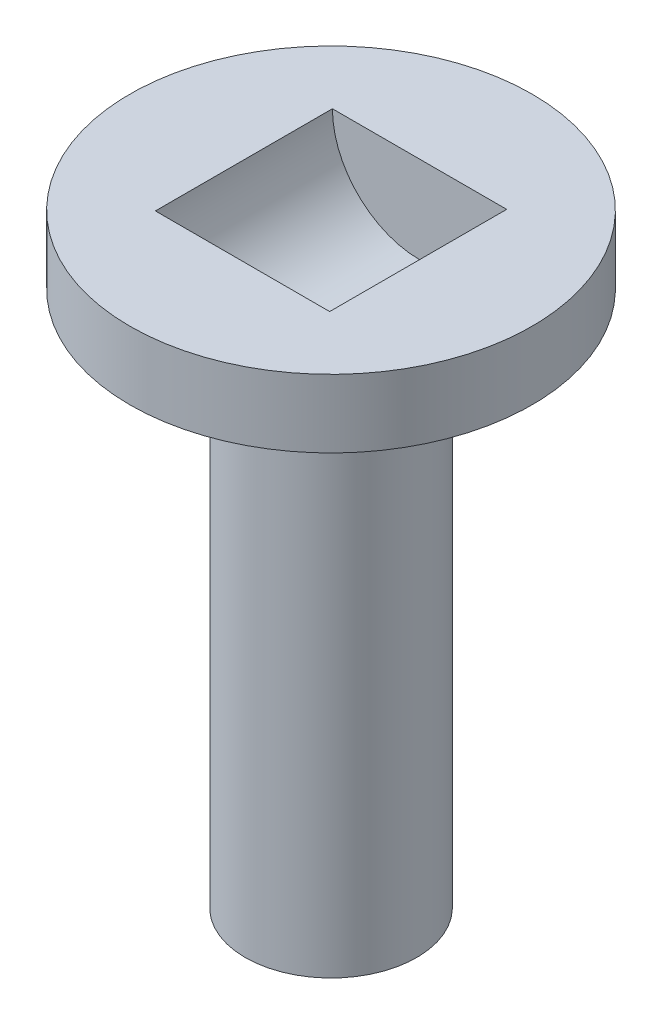
ISO-10303-21;
HEADER;
FILE_DESCRIPTION(('STEP AP214'),'2;1');
FILE_NAME('part.step','',(''),(''),'','','');
FILE_SCHEMA(('AUTOMOTIVE_DESIGN { 1 0 10303 214 1 1 1 1 }'));
ENDSEC;
DATA;
#1=APPLICATION_CONTEXT('core data for automotive mechanical design processes');
#2=APPLICATION_PROTOCOL_DEFINITION('international standard','automotive_design',2000,#1);
#3=PRODUCT_CONTEXT('',#1,'mechanical');
#4=PRODUCT('Part','Part','',(#3));
#5=PRODUCT_RELATED_PRODUCT_CATEGORY('part','',(#4));
#6=PRODUCT_DEFINITION_FORMATION('','',#4);
#7=PRODUCT_DEFINITION_CONTEXT('part definition',#1,'design');
#8=PRODUCT_DEFINITION('design','',#6,#7);
#9=PRODUCT_DEFINITION_SHAPE('','',#8);
#10=(LENGTH_UNIT() NAMED_UNIT(*) SI_UNIT(.MILLI.,.METRE.));
#11=(NAMED_UNIT(*) PLANE_ANGLE_UNIT() SI_UNIT($,.RADIAN.));
#12=(NAMED_UNIT(*) SI_UNIT($,.STERADIAN.) SOLID_ANGLE_UNIT());
#13=UNCERTAINTY_MEASURE_WITH_UNIT(LENGTH_MEASURE(1.E-05),#10,'distance_accuracy_value','');
#14=(GEOMETRIC_REPRESENTATION_CONTEXT(3) GLOBAL_UNCERTAINTY_ASSIGNED_CONTEXT((#13)) GLOBAL_UNIT_ASSIGNED_CONTEXT((#10,
#11,#12)) REPRESENTATION_CONTEXT('',''));
#15=CARTESIAN_POINT('',(0.,0.,0.));
#16=DIRECTION('',(0.,0.,1.));
#17=DIRECTION('',(1.,0.,0.));
#18=AXIS2_PLACEMENT_3D('',#15,#16,#17);
#19=CARTESIAN_POINT('',(0.,20.,0.));
#20=DIRECTION('',(0.,-1.,0.));
#21=DIRECTION('',(0.,0.,-1.));
#22=AXIS2_PLACEMENT_3D('',#19,#20,#21);
#23=CYLINDRICAL_SURFACE('',#22,3.2);
#24=CARTESIAN_POINT('',(0.,0.,0.));
#25=DIRECTION('',(0.,1.,0.));
#26=DIRECTION('',(0.,0.,1.));
#27=AXIS2_PLACEMENT_3D('',#24,#25,#26);
#28=CIRCLE('',#27,3.2);
#29=CARTESIAN_POINT('',(0.,0.,3.2));
#30=VERTEX_POINT('',#29);
#31=EDGE_CURVE('E76',#30,#30,#28,.T.);
#32=ORIENTED_EDGE('',*,*,#31,.T.);
#33=EDGE_LOOP('',(#32));
#34=FACE_BOUND('',#33,.T.);
#35=CARTESIAN_POINT('',(0.,19.19,0.));
#36=DIRECTION('',(0.,1.,0.));
#37=DIRECTION('',(0.,0.,1.));
#38=AXIS2_PLACEMENT_3D('',#35,#36,#37);
#39=CIRCLE('',#38,3.2);
#40=CARTESIAN_POINT('',(0.,19.19,3.2));
#41=VERTEX_POINT('',#40);
#42=EDGE_CURVE('E64',#41,#41,#39,.T.);
#43=ORIENTED_EDGE('',*,*,#42,.F.);
#44=EDGE_LOOP('',(#43));
#45=FACE_BOUND('',#44,.T.);
#46=ADVANCED_FACE('F34',(#34,#45),#23,.T.);
#47=CARTESIAN_POINT('',(0.,0.,0.));
#48=DIRECTION('',(0.,1.,0.));
#49=DIRECTION('',(0.,0.,1.));
#50=AXIS2_PLACEMENT_3D('',#47,#48,#49);
#51=PLANE('',#50);
#52=CARTESIAN_POINT('',(0.,0.,0.));
#53=DIRECTION('',(0.,-1.,0.));
#54=DIRECTION('',(0.,0.,-1.));
#55=AXIS2_PLACEMENT_3D('',#52,#53,#54);
#56=CIRCLE('',#55,1.1);
#57=CARTESIAN_POINT('',(0.,0.,-1.1));
#58=VERTEX_POINT('',#57);
#59=EDGE_CURVE('E80',#58,#58,#56,.T.);
#60=ORIENTED_EDGE('',*,*,#59,.F.);
#61=EDGE_LOOP('',(#60));
#62=FACE_BOUND('',#61,.T.);
#63=ORIENTED_EDGE('',*,*,#31,.F.);
#64=EDGE_LOOP('',(#63));
#65=FACE_BOUND('',#64,.T.);
#66=ADVANCED_FACE('F109',(#62,#65),#51,.F.);
#67=CARTESIAN_POINT('',(0.,10.,0.));
#68=DIRECTION('',(0.,-1.,0.));
#69=DIRECTION('',(0.,0.,-1.));
#70=AXIS2_PLACEMENT_3D('',#67,#68,#69);
#71=CYLINDRICAL_SURFACE('',#70,1.1);
#72=CARTESIAN_POINT('',(0.,10.,0.));
#73=DIRECTION('',(0.,-1.,0.));
#74=DIRECTION('',(0.,0.,-1.));
#75=AXIS2_PLACEMENT_3D('',#72,#73,#74);
#76=CIRCLE('',#75,1.1);
#77=CARTESIAN_POINT('',(0.,10.,-1.1));
#78=VERTEX_POINT('',#77);
#79=EDGE_CURVE('E79',#78,#78,#76,.T.);
#80=ORIENTED_EDGE('',*,*,#79,.F.);
#81=EDGE_LOOP('',(#80));
#82=FACE_BOUND('',#81,.T.);
#83=ORIENTED_EDGE('',*,*,#59,.T.);
#84=EDGE_LOOP('',(#83));
#85=FACE_BOUND('',#84,.T.);
#86=ADVANCED_FACE('F114',(#82,#85),#71,.F.);
#87=CARTESIAN_POINT('',(0.,10.,0.));
#88=DIRECTION('',(0.,-1.,0.));
#89=DIRECTION('',(0.,0.,-1.));
#90=AXIS2_PLACEMENT_3D('',#87,#88,#89);
#91=PLANE('',#90);
#92=ORIENTED_EDGE('',*,*,#79,.T.);
#93=EDGE_LOOP('',(#92));
#94=FACE_BOUND('',#93,.T.);
#95=ADVANCED_FACE('F123',(#94),#91,.T.);
#96=CARTESIAN_POINT('',(0.,19.19,0.));
#97=DIRECTION('',(0.,1.,0.));
#98=DIRECTION('',(0.,0.,1.));
#99=AXIS2_PLACEMENT_3D('',#96,#97,#98);
#100=PLANE('',#99);
#101=CARTESIAN_POINT('',(0.,19.19,0.));
#102=DIRECTION('',(0.,1.,0.));
#103=DIRECTION('',(0.,0.,1.));
#104=AXIS2_PLACEMENT_3D('',#101,#102,#103);
#105=CIRCLE('',#104,4.85);
#106=CARTESIAN_POINT('',(0.,19.19,4.85));
#107=VERTEX_POINT('',#106);
#108=EDGE_CURVE('E94',#107,#107,#105,.T.);
#109=ORIENTED_EDGE('',*,*,#108,.F.);
#110=EDGE_LOOP('',(#109));
#111=FACE_BOUND('',#110,.T.);
#112=ORIENTED_EDGE('',*,*,#42,.T.);
#113=EDGE_LOOP('',(#112));
#114=FACE_BOUND('',#113,.T.);
#115=ADVANCED_FACE('F120',(#111,#114),#100,.F.);
#116=CARTESIAN_POINT('',(0.,19.19,0.));
#117=DIRECTION('',(0.,1.,0.));
#118=DIRECTION('',(0.,0.,1.));
#119=AXIS2_PLACEMENT_3D('',#116,#117,#118);
#120=CYLINDRICAL_SURFACE('',#119,4.85);
#121=ORIENTED_EDGE('',*,*,#108,.T.);
#122=EDGE_LOOP('',(#121));
#123=FACE_BOUND('',#122,.T.);
#124=CARTESIAN_POINT('',(0.,20.,0.));
#125=DIRECTION('',(0.,1.,0.));
#126=DIRECTION('',(0.,0.,1.));
#127=AXIS2_PLACEMENT_3D('',#124,#125,#126);
#128=CIRCLE('',#127,4.85);
#129=CARTESIAN_POINT('',(0.,20.,4.85));
#130=VERTEX_POINT('',#129);
#131=EDGE_CURVE('E89',#130,#130,#128,.T.);
#132=ORIENTED_EDGE('',*,*,#131,.F.);
#133=EDGE_LOOP('',(#132));
#134=FACE_BOUND('',#133,.T.);
#135=ADVANCED_FACE('F122',(#123,#134),#120,.T.);
#136=CARTESIAN_POINT('',(0.,22.54,0.));
#137=DIRECTION('',(0.,1.,0.));
#138=DIRECTION('',(0.,0.,1.));
#139=AXIS2_PLACEMENT_3D('',#136,#137,#138);
#140=PLANE('',#139);
#141=DIRECTION('',(1.,0.,0.));
#142=VECTOR('',#141,1.);
#143=CARTESIAN_POINT('',(0.,22.54,3.3));
#144=LINE('',#143,#142);
#145=CARTESIAN_POINT('',(-3.25,22.54,3.3));
#146=VERTEX_POINT('',#145);
#147=CARTESIAN_POINT('',(3.25,22.54,3.3));
#148=VERTEX_POINT('',#147);
#149=EDGE_CURVE('E11',#146,#148,#144,.T.);
#150=ORIENTED_EDGE('',*,*,#149,.F.);
#151=DIRECTION('',(0.,0.,-1.));
#152=VECTOR('',#151,1.);
#153=CARTESIAN_POINT('',(-3.25,22.54,3.3));
#154=LINE('',#153,#152);
#155=CARTESIAN_POINT('',(-3.25,22.54,-3.302));
#156=VERTEX_POINT('',#155);
#157=EDGE_CURVE('E54',#146,#156,#154,.T.);
#158=ORIENTED_EDGE('',*,*,#157,.T.);
#159=DIRECTION('',(1.,0.,0.));
#160=VECTOR('',#159,1.);
#161=CARTESIAN_POINT('',(0.,22.54,-3.302));
#162=LINE('',#161,#160);
#163=CARTESIAN_POINT('',(3.25,22.54,-3.302));
#164=VERTEX_POINT('',#163);
#165=EDGE_CURVE('E60',#156,#164,#162,.T.);
#166=ORIENTED_EDGE('',*,*,#165,.T.);
#167=DIRECTION('',(0.,0.,-1.));
#168=VECTOR('',#167,1.);
#169=CARTESIAN_POINT('',(3.25,22.54,3.3));
#170=LINE('',#169,#168);
#171=EDGE_CURVE('E41',#164,#148,#170,.F.);
#172=ORIENTED_EDGE('',*,*,#171,.T.);
#173=EDGE_LOOP('',(#150,#158,#166,#172));
#174=FACE_BOUND('',#173,.T.);
#175=CARTESIAN_POINT('',(0.,22.54,0.));
#176=DIRECTION('',(0.,1.,0.));
#177=DIRECTION('',(0.,0.,1.));
#178=AXIS2_PLACEMENT_3D('',#175,#176,#177);
#179=CIRCLE('',#178,7.5);
#180=CARTESIAN_POINT('',(0.,22.54,7.5));
#181=VERTEX_POINT('',#180);
#182=EDGE_CURVE('E83',#181,#181,#179,.T.);
#183=ORIENTED_EDGE('',*,*,#182,.T.);
#184=EDGE_LOOP('',(#183));
#185=FACE_BOUND('',#184,.T.);
#186=ADVANCED_FACE('F70',(#174,#185),#140,.T.);
#187=CARTESIAN_POINT('',(0.,22.54,0.));
#188=DIRECTION('',(0.,-1.,0.));
#189=DIRECTION('',(0.,0.,-1.));
#190=AXIS2_PLACEMENT_3D('',#187,#188,#189);
#191=CYLINDRICAL_SURFACE('',#190,7.5);
#192=ORIENTED_EDGE('',*,*,#182,.F.);
#193=EDGE_LOOP('',(#192));
#194=FACE_BOUND('',#193,.T.);
#195=CARTESIAN_POINT('',(0.,20.,0.));
#196=DIRECTION('',(0.,1.,0.));
#197=DIRECTION('',(0.,0.,1.));
#198=AXIS2_PLACEMENT_3D('',#195,#196,#197);
#199=CIRCLE('',#198,7.5);
#200=CARTESIAN_POINT('',(0.,20.,7.5));
#201=VERTEX_POINT('',#200);
#202=EDGE_CURVE('E86',#201,#201,#199,.T.);
#203=ORIENTED_EDGE('',*,*,#202,.T.);
#204=EDGE_LOOP('',(#203));
#205=FACE_BOUND('',#204,.T.);
#206=ADVANCED_FACE('F138',(#194,#205),#191,.T.);
#207=CARTESIAN_POINT('',(0.,20.,0.));
#208=DIRECTION('',(0.,1.,0.));
#209=DIRECTION('',(0.,0.,1.));
#210=AXIS2_PLACEMENT_3D('',#207,#208,#209);
#211=PLANE('',#210);
#212=ORIENTED_EDGE('',*,*,#131,.T.);
#213=EDGE_LOOP('',(#212));
#214=FACE_BOUND('',#213,.T.);
#215=ORIENTED_EDGE('',*,*,#202,.F.);
#216=EDGE_LOOP('',(#215));
#217=FACE_BOUND('',#216,.T.);
#218=ADVANCED_FACE('F106',(#214,#217),#211,.F.);
#219=CARTESIAN_POINT('',(0.,22.54,3.3));
#220=DIRECTION('',(0.,0.,-1.));
#221=DIRECTION('',(-1.,0.,0.));
#222=AXIS2_PLACEMENT_3D('',#219,#220,#221);
#223=CYLINDRICAL_SURFACE('',#222,3.25);
#224=CARTESIAN_POINT('',(0.,22.54,-3.302));
#225=DIRECTION('',(0.,0.,1.));
#226=DIRECTION('',(1.,0.,0.));
#227=AXIS2_PLACEMENT_3D('',#224,#225,#226);
#228=CIRCLE('',#227,3.25);
#229=EDGE_CURVE('E47',#156,#164,#228,.T.);
#230=ORIENTED_EDGE('',*,*,#229,.F.);
#231=ORIENTED_EDGE('',*,*,#157,.F.);
#232=CARTESIAN_POINT('',(0.,22.54,3.3));
#233=DIRECTION('',(0.,0.,1.));
#234=DIRECTION('',(1.,0.,0.));
#235=AXIS2_PLACEMENT_3D('',#232,#233,#234);
#236=CIRCLE('',#235,3.25);
#237=EDGE_CURVE('E67',#146,#148,#236,.T.);
#238=ORIENTED_EDGE('',*,*,#237,.T.);
#239=ORIENTED_EDGE('',*,*,#171,.F.);
#240=EDGE_LOOP('',(#230,#231,#238,#239));
#241=FACE_BOUND('',#240,.T.);
#242=ADVANCED_FACE('F66',(#241),#223,.F.);
#243=CARTESIAN_POINT('',(0.,22.54,3.3));
#244=DIRECTION('',(0.,0.,1.));
#245=DIRECTION('',(1.,0.,0.));
#246=AXIS2_PLACEMENT_3D('',#243,#244,#245);
#247=PLANE('',#246);
#248=ORIENTED_EDGE('',*,*,#149,.T.);
#249=ORIENTED_EDGE('',*,*,#237,.F.);
#250=EDGE_LOOP('',(#248,#249));
#251=FACE_BOUND('',#250,.T.);
#252=ADVANCED_FACE('F98',(#251),#247,.F.);
#253=CARTESIAN_POINT('',(0.,22.54,-3.302));
#254=DIRECTION('',(0.,0.,1.));
#255=DIRECTION('',(1.,0.,0.));
#256=AXIS2_PLACEMENT_3D('',#253,#254,#255);
#257=PLANE('',#256);
#258=ORIENTED_EDGE('',*,*,#229,.T.);
#259=ORIENTED_EDGE('',*,*,#165,.F.);
#260=EDGE_LOOP('',(#258,#259));
#261=FACE_BOUND('',#260,.T.);
#262=ADVANCED_FACE('F61',(#261),#257,.T.);
#263=CLOSED_SHELL('',(#46,#66,#86,#95,#115,#135,#186,#206,#218,#242,#252,#262));
#264=MANIFOLD_SOLID_BREP('B2',#263);
#265=ADVANCED_BREP_SHAPE_REPRESENTATION('',(#18,#264),#14);
#266=SHAPE_DEFINITION_REPRESENTATION(#9,#265);
ENDSEC;
END-ISO-10303-21;
